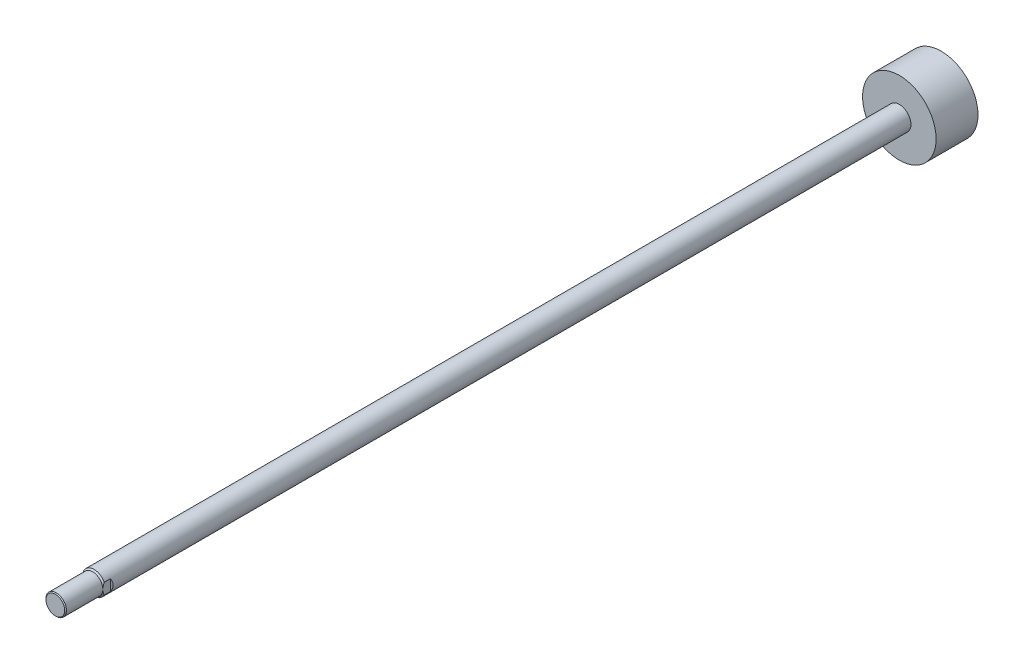
ISO-10303-21;
HEADER;
FILE_DESCRIPTION(('STEP AP214'),'2;1');
FILE_NAME('part.step','',(''),(''),'','','');
FILE_SCHEMA(('AUTOMOTIVE_DESIGN { 1 0 10303 214 1 1 1 1 }'));
ENDSEC;
DATA;
#1=APPLICATION_CONTEXT('core data for automotive mechanical design processes');
#2=APPLICATION_PROTOCOL_DEFINITION('international standard','automotive_design',2000,#1);
#3=PRODUCT_CONTEXT('',#1,'mechanical');
#4=PRODUCT('Part','Part','',(#3));
#5=PRODUCT_RELATED_PRODUCT_CATEGORY('part','',(#4));
#6=PRODUCT_DEFINITION_FORMATION('','',#4);
#7=PRODUCT_DEFINITION_CONTEXT('part definition',#1,'design');
#8=PRODUCT_DEFINITION('design','',#6,#7);
#9=PRODUCT_DEFINITION_SHAPE('','',#8);
#10=(LENGTH_UNIT() NAMED_UNIT(*) SI_UNIT(.MILLI.,.METRE.));
#11=(NAMED_UNIT(*) PLANE_ANGLE_UNIT() SI_UNIT($,.RADIAN.));
#12=(NAMED_UNIT(*) SI_UNIT($,.STERADIAN.) SOLID_ANGLE_UNIT());
#13=UNCERTAINTY_MEASURE_WITH_UNIT(LENGTH_MEASURE(1.E-05),#10,'distance_accuracy_value','');
#14=(GEOMETRIC_REPRESENTATION_CONTEXT(3) GLOBAL_UNCERTAINTY_ASSIGNED_CONTEXT((#13)) GLOBAL_UNIT_ASSIGNED_CONTEXT((#10,
#11,#12)) REPRESENTATION_CONTEXT('',''));
#15=CARTESIAN_POINT('',(0.,0.,0.));
#16=DIRECTION('',(0.,0.,1.));
#17=DIRECTION('',(1.,0.,0.));
#18=AXIS2_PLACEMENT_3D('',#15,#16,#17);
#19=CARTESIAN_POINT('',(0.,0.,10.5000000000001));
#20=DIRECTION('',(0.,0.,-1.));
#21=DIRECTION('',(-1.,0.,0.));
#22=AXIS2_PLACEMENT_3D('',#19,#20,#21);
#23=CONICAL_SURFACE('',#22,12.5,0.785398163397467);
#24=CARTESIAN_POINT('',(0.,0.,10.5000000000001));
#25=DIRECTION('',(0.,0.,1.));
#26=DIRECTION('',(1.,0.,0.));
#27=AXIS2_PLACEMENT_3D('',#24,#25,#26);
#28=CIRCLE('',#27,12.5);
#29=CARTESIAN_POINT('',(11.,5.93717104351896,10.5000000000001));
#30=VERTEX_POINT('',#29);
#31=CARTESIAN_POINT('',(-11.,5.93717104351896,10.5000000000001));
#32=VERTEX_POINT('',#31);
#33=EDGE_CURVE('E120',#30,#32,#28,.T.);
#34=ORIENTED_EDGE('',*,*,#33,.T.);
#35=CARTESIAN_POINT('',(-11.,-30.3737777901921,-9.30427800226955));
#36=CARTESIAN_POINT('',(-11.,-30.0229063540529,-8.97437695331711));
#37=CARTESIAN_POINT('',(-11.,-29.6717066790662,-8.64482502476977));
#38=CARTESIAN_POINT('',(-11.,-28.9685770270119,-7.98649999018541));
#39=CARTESIAN_POINT('',(-11.,-28.6166470486584,-7.65772688552205));
#40=CARTESIAN_POINT('',(-11.,-27.5596186699526,-6.67266663693586));
#41=CARTESIAN_POINT('',(-11.,-26.8533157788468,-6.01767051110847));
#42=CARTESIAN_POINT('',(-11.,-25.4349123512362,-4.71026616975852));
#43=CARTESIAN_POINT('',(-11.,-24.7228015119403,-4.05786912051483));
#44=CARTESIAN_POINT('',(-11.,-23.2936170840664,-2.75857202015826));
#45=CARTESIAN_POINT('',(-11.,-22.5765436397661,-2.11167181044391));
#46=CARTESIAN_POINT('',(-11.,-21.0606945297453,-0.757615978221944));
#47=CARTESIAN_POINT('',(-11.,-20.2612212573375,-0.0512385887505946));
#48=CARTESIAN_POINT('',(-11.,-19.0542106064668,0.999453534212534));
#49=CARTESIAN_POINT('',(-11.,-18.6505514081433,1.34822399666167));
#50=CARTESIAN_POINT('',(-11.,-17.8401937123821,2.04221745773091));
#51=CARTESIAN_POINT('',(-11.,-17.4334952257531,2.38744046895657));
#52=CARTESIAN_POINT('',(-11.,-16.6170993334455,3.0731590701502));
#53=CARTESIAN_POINT('',(-11.,-16.2074069270912,3.413660605241));
#54=CARTESIAN_POINT('',(-11.,-15.3837941215437,4.08953454430709));
#55=CARTESIAN_POINT('',(-11.,-14.9698736499337,4.42490686018441));
#56=CARTESIAN_POINT('',(-11.,-14.1370695660154,5.08928571580761));
#57=CARTESIAN_POINT('',(-11.,-13.7181868734802,5.41829340639865));
#58=CARTESIAN_POINT('',(-11.,-12.8743810744199,6.06845305145992));
#59=CARTESIAN_POINT('',(-11.,-12.4494582668419,6.38960539259393));
#60=CARTESIAN_POINT('',(-11.,-11.6784557577223,6.95839901584683));
#61=CARTESIAN_POINT('',(-11.,-11.3337033170845,7.20783666055259));
#62=CARTESIAN_POINT('',(-11.,-10.6386998782597,7.69897273167353));
#63=CARTESIAN_POINT('',(-11.,-10.2884487525087,7.94067097814588));
#64=CARTESIAN_POINT('',(-11.,-9.58092508069719,8.41490262835491));
#65=CARTESIAN_POINT('',(-11.,-9.22364179900027,8.64742007542739));
#66=CARTESIAN_POINT('',(-11.,-8.5015342266699,9.10046734630099));
#67=CARTESIAN_POINT('',(-11.,-8.13671023098719,9.3209976377528));
#68=CARTESIAN_POINT('',(-11.,-7.40619318173111,9.74237663896798));
#69=CARTESIAN_POINT('',(-11.,-7.04068604274017,9.94354569077682));
#70=CARTESIAN_POINT('',(-11.,-6.30000413092141,10.3275986353661));
#71=CARTESIAN_POINT('',(-11.,-5.92482731055884,10.5104786147949));
#72=CARTESIAN_POINT('',(-11.,-5.16503852122758,10.8524533149703));
#73=CARTESIAN_POINT('',(-11.,-4.78045826730282,11.0116178096462));
#74=CARTESIAN_POINT('',(-11.,-4.00057373635847,11.3006950374231));
#75=CARTESIAN_POINT('',(-11.,-3.6052777808523,11.43062977939));
#76=CARTESIAN_POINT('',(-11.,-2.93173933823261,11.6190388059141));
#77=CARTESIAN_POINT('',(-11.,-2.65617699403574,11.6871038553572));
#78=CARTESIAN_POINT('',(-11.,-2.10100533429474,11.8044358751432));
#79=CARTESIAN_POINT('',(-11.,-1.82139571113459,11.8537014087471));
#80=CARTESIAN_POINT('',(-11.,-1.26014853276528,11.9315306660556));
#81=CARTESIAN_POINT('',(-11.,-0.978519765258069,11.9601570798599));
#82=CARTESIAN_POINT('',(-11.,-0.413884147058562,11.9958235803247));
#83=CARTESIAN_POINT('',(-11.,-0.13087725978694,12.0028630908429));
#84=CARTESIAN_POINT('',(-11.,0.483720502296104,11.9943609657316));
#85=CARTESIAN_POINT('',(-11.,0.81526124951187,11.9747097024158));
#86=CARTESIAN_POINT('',(-11.,1.47533853964694,11.9063652029098));
#87=CARTESIAN_POINT('',(-11.,1.80387446821454,11.8576661568047));
#88=CARTESIAN_POINT('',(-11.,2.45960905462746,11.7330215715066));
#89=CARTESIAN_POINT('',(-11.,2.78674828640074,11.6567673842277));
#90=CARTESIAN_POINT('',(-11.,3.43442351034812,11.4805342077058));
#91=CARTESIAN_POINT('',(-11.,3.75496060244845,11.3805592057055));
#92=CARTESIAN_POINT('',(-11.,4.43860398219218,11.1432333450099));
#93=CARTESIAN_POINT('',(-11.,4.80052089453188,11.0024816953722));
#94=CARTESIAN_POINT('',(-11.,5.51514756853484,10.6991023941188));
#95=CARTESIAN_POINT('',(-11.,5.86785294863752,10.5364645505205));
#96=CARTESIAN_POINT('',(-11.,6.56572434411173,10.1931210622779));
#97=CARTESIAN_POINT('',(-11.,6.9108618867172,10.0123579928071));
#98=CARTESIAN_POINT('',(-11.,7.59326398254634,9.63674700867484));
#99=CARTESIAN_POINT('',(-11.,7.93052975814919,9.44190130036884));
#100=CARTESIAN_POINT('',(-11.,8.58397946116312,9.04939310932823));
#101=CARTESIAN_POINT('',(-11.,8.90044939127748,8.85220428937632));
#102=CARTESIAN_POINT('',(-11.,9.5279192078348,8.44928060590444));
#103=CARTESIAN_POINT('',(-11.,9.83891865777885,8.24354506479058));
#104=CARTESIAN_POINT('',(-11.,10.4536287734865,7.82674595883109));
#105=CARTESIAN_POINT('',(-11.,10.7573781228191,7.61573923887487));
#106=CARTESIAN_POINT('',(-11.,11.3606748546706,7.18797464933807));
#107=CARTESIAN_POINT('',(-11.,11.6602234083216,6.9712184334145));
#108=CARTESIAN_POINT('',(-11.,11.9580092344666,6.75210829517929));
#109=B_SPLINE_CURVE_WITH_KNOTS('',3,(#35,#36,#37,#38,#39,#40,#41,#42,#43,#44,#45,#46,#47,#48,
#49,#50,#51,#52,#53,#54,#55,#56,#57,#58,#59,#60,#61,#62,#63,#64,#65,#66,#67,#68,#69,#70,#71,#72,
#73,#74,#75,#76,#77,#78,#79,#80,#81,#82,#83,#84,#85,#86,#87,#88,#89,#90,#91,#92,#93,#94,#95,#96,
#97,#98,#99,#100,#101,#102,#103,#104,#105,#106,#107,#108),.UNSPECIFIED.,.F.,.F.,(4,2,2,2,2,2,2,
2,2,2,2,2,2,2,2,2,2,2,2,2,2,2,2,2,2,2,2,2,2,2,2,2,2,2,2,2,4),(0.,1.44482111634278,
2.88964477910512,5.77943197448876,8.67673740717784,11.5739589574956,14.7743498753899,
16.3747196187949,17.9750836734584,19.5732057841902,21.1713553130435,22.7692131127942,
24.3669921022818,25.6434886843687,26.9200149237839,28.1986700566298,29.4772752698982,
30.7284995702251,31.9799910274049,33.2277244758003,34.4745152612281,35.3254842608641,
36.1765182821512,37.0249563212923,37.8734170045637,38.8684037373762,39.8635895465815,
40.8702868077079,41.8768149723518,43.0408783830398,44.2054857639148,45.3739070401562,
46.542145652645,47.6606130892623,48.7791693691289,49.8886408706045,50.997796656384),.UNSPECIFIED.);
#110=CARTESIAN_POINT('',(-11.,0.,12.));
#111=VERTEX_POINT('',#110);
#112=EDGE_CURVE('E90',#32,#111,#109,.F.);
#113=ORIENTED_EDGE('',*,*,#112,.T.);
#114=CARTESIAN_POINT('',(0.,0.,12.));
#115=DIRECTION('',(0.,0.,1.));
#116=DIRECTION('',(1.,0.,0.));
#117=AXIS2_PLACEMENT_3D('',#114,#115,#116);
#118=CIRCLE('',#117,11.);
#119=CARTESIAN_POINT('',(11.,0.,12.));
#120=VERTEX_POINT('',#119);
#121=EDGE_CURVE('E116',#120,#111,#118,.T.);
#122=ORIENTED_EDGE('',*,*,#121,.F.);
#123=CARTESIAN_POINT('',(11.,-30.3737777901921,-9.30427800226955));
#124=CARTESIAN_POINT('',(11.,-30.0229063540529,-8.97437695331711));
#125=CARTESIAN_POINT('',(11.,-29.6717066790662,-8.64482502476977));
#126=CARTESIAN_POINT('',(11.,-28.9685770270119,-7.98649999018541));
#127=CARTESIAN_POINT('',(11.,-28.6166470486584,-7.65772688552205));
#128=CARTESIAN_POINT('',(11.,-27.5596186699526,-6.67266663693586));
#129=CARTESIAN_POINT('',(11.,-26.8533157788468,-6.01767051110847));
#130=CARTESIAN_POINT('',(11.,-25.4349123512362,-4.71026616975852));
#131=CARTESIAN_POINT('',(11.,-24.7228015119403,-4.05786912051483));
#132=CARTESIAN_POINT('',(11.,-23.2936170840664,-2.75857202015826));
#133=CARTESIAN_POINT('',(11.,-22.5765436397661,-2.11167181044391));
#134=CARTESIAN_POINT('',(11.,-21.0606945297453,-0.757615978221944));
#135=CARTESIAN_POINT('',(11.,-20.2612212573375,-0.0512385887505946));
#136=CARTESIAN_POINT('',(11.,-19.0542106064668,0.999453534212534));
#137=CARTESIAN_POINT('',(11.,-18.6505514081433,1.34822399666167));
#138=CARTESIAN_POINT('',(11.,-17.8401937123821,2.04221745773091));
#139=CARTESIAN_POINT('',(11.,-17.4334952257531,2.38744046895657));
#140=CARTESIAN_POINT('',(11.,-16.6170993334455,3.0731590701502));
#141=CARTESIAN_POINT('',(11.,-16.2074069270912,3.413660605241));
#142=CARTESIAN_POINT('',(11.,-15.3837941215437,4.08953454430709));
#143=CARTESIAN_POINT('',(11.,-14.9698736499337,4.42490686018441));
#144=CARTESIAN_POINT('',(11.,-14.1370695660154,5.08928571580761));
#145=CARTESIAN_POINT('',(11.,-13.7181868734802,5.41829340639865));
#146=CARTESIAN_POINT('',(11.,-12.8743810744199,6.06845305145992));
#147=CARTESIAN_POINT('',(11.,-12.4494582668419,6.38960539259393));
#148=CARTESIAN_POINT('',(11.,-11.6784557577223,6.95839901584683));
#149=CARTESIAN_POINT('',(11.,-11.3337033170845,7.20783666055259));
#150=CARTESIAN_POINT('',(11.,-10.6386998782597,7.69897273167353));
#151=CARTESIAN_POINT('',(11.,-10.2884487525087,7.94067097814588));
#152=CARTESIAN_POINT('',(11.,-9.58092508069719,8.41490262835491));
#153=CARTESIAN_POINT('',(11.,-9.22364179900027,8.64742007542739));
#154=CARTESIAN_POINT('',(11.,-8.5015342266699,9.10046734630099));
#155=CARTESIAN_POINT('',(11.,-8.13671023098719,9.3209976377528));
#156=CARTESIAN_POINT('',(11.,-7.40619318173111,9.74237663896798));
#157=CARTESIAN_POINT('',(11.,-7.04068604274017,9.94354569077682));
#158=CARTESIAN_POINT('',(11.,-6.30000413092141,10.3275986353661));
#159=CARTESIAN_POINT('',(11.,-5.92482731055884,10.5104786147949));
#160=CARTESIAN_POINT('',(11.,-5.16503852122758,10.8524533149703));
#161=CARTESIAN_POINT('',(11.,-4.78045826730282,11.0116178096462));
#162=CARTESIAN_POINT('',(11.,-4.00057373635847,11.3006950374231));
#163=CARTESIAN_POINT('',(11.,-3.6052777808523,11.43062977939));
#164=CARTESIAN_POINT('',(11.,-2.93173933823261,11.6190388059141));
#165=CARTESIAN_POINT('',(11.,-2.65617699403574,11.6871038553572));
#166=CARTESIAN_POINT('',(11.,-2.10100533429474,11.8044358751432));
#167=CARTESIAN_POINT('',(11.,-1.82139571113459,11.8537014087471));
#168=CARTESIAN_POINT('',(11.,-1.26014853276528,11.9315306660556));
#169=CARTESIAN_POINT('',(11.,-0.978519765258069,11.9601570798599));
#170=CARTESIAN_POINT('',(11.,-0.413884147058562,11.9958235803247));
#171=CARTESIAN_POINT('',(11.,-0.13087725978694,12.0028630908429));
#172=CARTESIAN_POINT('',(11.,0.483720502296104,11.9943609657316));
#173=CARTESIAN_POINT('',(11.,0.81526124951187,11.9747097024158));
#174=CARTESIAN_POINT('',(11.,1.47533853964694,11.9063652029098));
#175=CARTESIAN_POINT('',(11.,1.80387446821454,11.8576661568047));
#176=CARTESIAN_POINT('',(11.,2.45960905462746,11.7330215715066));
#177=CARTESIAN_POINT('',(11.,2.78674828640074,11.6567673842277));
#178=CARTESIAN_POINT('',(11.,3.43442351034812,11.4805342077058));
#179=CARTESIAN_POINT('',(11.,3.75496060244845,11.3805592057055));
#180=CARTESIAN_POINT('',(11.,4.43860398219218,11.1432333450099));
#181=CARTESIAN_POINT('',(11.,4.80052089453188,11.0024816953722));
#182=CARTESIAN_POINT('',(11.,5.51514756853484,10.6991023941188));
#183=CARTESIAN_POINT('',(11.,5.86785294863752,10.5364645505205));
#184=CARTESIAN_POINT('',(11.,6.56572434411173,10.1931210622779));
#185=CARTESIAN_POINT('',(11.,6.9108618867172,10.0123579928071));
#186=CARTESIAN_POINT('',(11.,7.59326398254634,9.63674700867484));
#187=CARTESIAN_POINT('',(11.,7.93052975814919,9.44190130036884));
#188=CARTESIAN_POINT('',(11.,8.58397946116312,9.04939310932823));
#189=CARTESIAN_POINT('',(11.,8.90044939127748,8.85220428937632));
#190=CARTESIAN_POINT('',(11.,9.5279192078348,8.44928060590444));
#191=CARTESIAN_POINT('',(11.,9.83891865777885,8.24354506479058));
#192=CARTESIAN_POINT('',(11.,10.4536287734865,7.82674595883109));
#193=CARTESIAN_POINT('',(11.,10.7573781228191,7.61573923887487));
#194=CARTESIAN_POINT('',(11.,11.3606748546706,7.18797464933807));
#195=CARTESIAN_POINT('',(11.,11.6602234083216,6.9712184334145));
#196=CARTESIAN_POINT('',(11.,11.9580092344666,6.75210829517929));
#197=B_SPLINE_CURVE_WITH_KNOTS('',3,(#123,#124,#125,#126,#127,#128,#129,#130,#131,#132,#133,
#134,#135,#136,#137,#138,#139,#140,#141,#142,#143,#144,#145,#146,#147,#148,#149,#150,#151,#152,
#153,#154,#155,#156,#157,#158,#159,#160,#161,#162,#163,#164,#165,#166,#167,#168,#169,#170,#171,
#172,#173,#174,#175,#176,#177,#178,#179,#180,#181,#182,#183,#184,#185,#186,#187,#188,#189,#190,
#191,#192,#193,#194,#195,#196),.UNSPECIFIED.,.F.,.F.,(4,2,2,2,2,2,2,2,2,2,2,2,2,2,2,2,2,2,2,2,2,
2,2,2,2,2,2,2,2,2,2,2,2,2,2,2,4),(0.,1.44482111634278,2.88964477910512,5.77943197448876,
8.67673740717784,11.5739589574956,14.7743498753899,16.3747196187949,17.9750836734584,
19.5732057841902,21.1713553130435,22.7692131127942,24.3669921022818,25.6434886843687,
26.9200149237839,28.1986700566298,29.4772752698982,30.7284995702251,31.9799910274049,
33.2277244758003,34.4745152612281,35.3254842608641,36.1765182821512,37.0249563212923,
37.8734170045637,38.8684037373762,39.8635895465815,40.8702868077079,41.8768149723518,
43.0408783830398,44.2054857639148,45.3739070401562,46.542145652645,47.6606130892623,
48.7791693691289,49.8886408706045,50.997796656384),.UNSPECIFIED.);
#198=EDGE_CURVE('E133',#120,#30,#197,.T.);
#199=ORIENTED_EDGE('',*,*,#198,.T.);
#200=EDGE_LOOP('',(#34,#113,#122,#199));
#201=FACE_BOUND('',#200,.T.);
#202=ADVANCED_FACE('F39',(#201),#23,.T.);
#203=CARTESIAN_POINT('',(0.,0.,52.));
#204=DIRECTION('',(0.,0.,-1.));
#205=DIRECTION('',(-1.,0.,0.));
#206=AXIS2_PLACEMENT_3D('',#203,#204,#205);
#207=PLANE('',#206);
#208=CARTESIAN_POINT('',(0.,0.,52.));
#209=DIRECTION('',(0.,0.,1.));
#210=DIRECTION('',(1.,0.,0.));
#211=AXIS2_PLACEMENT_3D('',#208,#209,#210);
#212=CIRCLE('',#211,10.08);
#213=CARTESIAN_POINT('',(10.08,0.,52.));
#214=VERTEX_POINT('',#213);
#215=EDGE_CURVE('E110',#214,#214,#212,.T.);
#216=ORIENTED_EDGE('',*,*,#215,.T.);
#217=EDGE_LOOP('',(#216));
#218=FACE_BOUND('',#217,.T.);
#219=ADVANCED_FACE('F41',(#218),#207,.F.);
#220=CARTESIAN_POINT('',(0.,0.,51.08));
#221=DIRECTION('',(0.,0.,-1.));
#222=DIRECTION('',(-1.,0.,0.));
#223=AXIS2_PLACEMENT_3D('',#220,#221,#222);
#224=CONICAL_SURFACE('',#223,11.,0.78539816339743);
#225=ORIENTED_EDGE('',*,*,#215,.F.);
#226=EDGE_LOOP('',(#225));
#227=FACE_BOUND('',#226,.T.);
#228=CARTESIAN_POINT('',(0.,0.,51.08));
#229=DIRECTION('',(0.,0.,1.));
#230=DIRECTION('',(1.,0.,0.));
#231=AXIS2_PLACEMENT_3D('',#228,#229,#230);
#232=CIRCLE('',#231,11.);
#233=CARTESIAN_POINT('',(11.,0.,51.08));
#234=VERTEX_POINT('',#233);
#235=EDGE_CURVE('E113',#234,#234,#232,.T.);
#236=ORIENTED_EDGE('',*,*,#235,.T.);
#237=EDGE_LOOP('',(#236));
#238=FACE_BOUND('',#237,.T.);
#239=ADVANCED_FACE('F178',(#227,#238),#224,.T.);
#240=CARTESIAN_POINT('',(0.,0.,-899.5));
#241=DIRECTION('',(0.,0.,1.));
#242=DIRECTION('',(1.,0.,0.));
#243=AXIS2_PLACEMENT_3D('',#240,#241,#242);
#244=CYLINDRICAL_SURFACE('',#243,11.);
#245=ORIENTED_EDGE('',*,*,#235,.F.);
#246=EDGE_LOOP('',(#245));
#247=FACE_BOUND('',#246,.T.);
#248=ORIENTED_EDGE('',*,*,#121,.T.);
#249=EDGE_CURVE('E119',#111,#120,#118,.T.);
#250=ORIENTED_EDGE('',*,*,#249,.T.);
#251=EDGE_LOOP('',(#248,#250));
#252=FACE_BOUND('',#251,.T.);
#253=ADVANCED_FACE('F171',(#247,#252),#244,.T.);
#254=ORIENTED_EDGE('',*,*,#249,.F.);
#255=CARTESIAN_POINT('',(-11.,-5.93717104351896,10.5000000000001));
#256=VERTEX_POINT('',#255);
#257=EDGE_CURVE('E95',#111,#256,#109,.F.);
#258=ORIENTED_EDGE('',*,*,#257,.T.);
#259=CARTESIAN_POINT('',(11.,-5.93717104351896,10.5000000000001));
#260=VERTEX_POINT('',#259);
#261=EDGE_CURVE('E122',#256,#260,#28,.T.);
#262=ORIENTED_EDGE('',*,*,#261,.T.);
#263=EDGE_CURVE('E132',#260,#120,#197,.T.);
#264=ORIENTED_EDGE('',*,*,#263,.T.);
#265=EDGE_LOOP('',(#254,#258,#262,#264));
#266=FACE_BOUND('',#265,.T.);
#267=ADVANCED_FACE('F142',(#266),#23,.T.);
#268=CARTESIAN_POINT('',(0.,0.,-899.5));
#269=DIRECTION('',(0.,0.,1.));
#270=DIRECTION('',(1.,0.,0.));
#271=AXIS2_PLACEMENT_3D('',#268,#269,#270);
#272=CYLINDRICAL_SURFACE('',#271,12.5);
#273=DIRECTION('',(0.,0.,1.));
#274=VECTOR('',#273,1.);
#275=CARTESIAN_POINT('',(-11.,-5.93717104351896,-899.5));
#276=LINE('',#275,#274);
#277=CARTESIAN_POINT('',(-11.,-5.93717104351896,3.90000000000001));
#278=VERTEX_POINT('',#277);
#279=EDGE_CURVE('E11',#256,#278,#276,.F.);
#280=ORIENTED_EDGE('',*,*,#279,.T.);
#281=CARTESIAN_POINT('',(0.,0.,14.8999999999999));
#282=DIRECTION('',(0.707106781186546,0.,-0.707106781186549));
#283=DIRECTION('',(0.707106781186549,0.,0.707106781186546));
#284=AXIS2_PLACEMENT_3D('',#281,#282,#283);
#285=ELLIPSE('',#284,17.6776695296636,12.5);
#286=CARTESIAN_POINT('',(-11.,5.93717104351896,3.89999999999999));
#287=VERTEX_POINT('',#286);
#288=EDGE_CURVE('E53',#278,#287,#285,.T.);
#289=ORIENTED_EDGE('',*,*,#288,.T.);
#290=DIRECTION('',(0.,0.,1.));
#291=VECTOR('',#290,1.);
#292=CARTESIAN_POINT('',(-11.,5.93717104351896,-899.5));
#293=LINE('',#292,#291);
#294=EDGE_CURVE('E47',#287,#32,#293,.T.);
#295=ORIENTED_EDGE('',*,*,#294,.T.);
#296=ORIENTED_EDGE('',*,*,#33,.F.);
#297=DIRECTION('',(0.,0.,1.));
#298=VECTOR('',#297,1.);
#299=CARTESIAN_POINT('',(11.,5.93717104351896,-899.5));
#300=LINE('',#299,#298);
#301=CARTESIAN_POINT('',(11.,5.93717104351896,3.90000000000001));
#302=VERTEX_POINT('',#301);
#303=EDGE_CURVE('E107',#30,#302,#300,.F.);
#304=ORIENTED_EDGE('',*,*,#303,.T.);
#305=CARTESIAN_POINT('',(0.,0.,14.8999999999998));
#306=DIRECTION('',(-0.707106781186542,0.,-0.707106781186553));
#307=DIRECTION('',(-0.707106781186553,0.,0.707106781186542));
#308=AXIS2_PLACEMENT_3D('',#305,#306,#307);
#309=ELLIPSE('',#308,17.6776695296635,12.5);
#310=CARTESIAN_POINT('',(11.,-5.93717104351896,3.89999999999998));
#311=VERTEX_POINT('',#310);
#312=EDGE_CURVE('E103',#302,#311,#309,.T.);
#313=ORIENTED_EDGE('',*,*,#312,.T.);
#314=DIRECTION('',(0.,0.,1.));
#315=VECTOR('',#314,1.);
#316=CARTESIAN_POINT('',(11.,-5.93717104351896,-899.5));
#317=LINE('',#316,#315);
#318=EDGE_CURVE('E100',#311,#260,#317,.T.);
#319=ORIENTED_EDGE('',*,*,#318,.T.);
#320=ORIENTED_EDGE('',*,*,#261,.F.);
#321=EDGE_LOOP('',(#280,#289,#295,#296,#304,#313,#319,#320));
#322=FACE_BOUND('',#321,.T.);
#323=CARTESIAN_POINT('',(0.,0.,-854.5));
#324=DIRECTION('',(0.,0.,1.));
#325=DIRECTION('',(1.,0.,0.));
#326=AXIS2_PLACEMENT_3D('',#323,#324,#325);
#327=CIRCLE('',#326,12.5);
#328=CARTESIAN_POINT('',(12.5,0.,-854.5));
#329=VERTEX_POINT('',#328);
#330=EDGE_CURVE('E123',#329,#329,#327,.T.);
#331=ORIENTED_EDGE('',*,*,#330,.T.);
#332=EDGE_LOOP('',(#331));
#333=FACE_BOUND('',#332,.T.);
#334=ADVANCED_FACE('F97',(#322,#333),#272,.T.);
#335=CARTESIAN_POINT('',(0.,12.5,-854.5));
#336=DIRECTION('',(0.,0.,-1.));
#337=DIRECTION('',(-1.,0.,0.));
#338=AXIS2_PLACEMENT_3D('',#335,#336,#337);
#339=PLANE('',#338);
#340=ORIENTED_EDGE('',*,*,#330,.F.);
#341=EDGE_LOOP('',(#340));
#342=FACE_BOUND('',#341,.T.);
#343=CARTESIAN_POINT('',(0.,0.,-854.5));
#344=DIRECTION('',(0.,0.,1.));
#345=DIRECTION('',(1.,0.,0.));
#346=AXIS2_PLACEMENT_3D('',#343,#344,#345);
#347=CIRCLE('',#346,39.5);
#348=CARTESIAN_POINT('',(39.5,0.,-854.5));
#349=VERTEX_POINT('',#348);
#350=EDGE_CURVE('E126',#349,#349,#347,.T.);
#351=ORIENTED_EDGE('',*,*,#350,.T.);
#352=EDGE_LOOP('',(#351));
#353=FACE_BOUND('',#352,.T.);
#354=ADVANCED_FACE('F163',(#342,#353),#339,.F.);
#355=CARTESIAN_POINT('',(0.,0.,-899.5));
#356=DIRECTION('',(0.,0.,1.));
#357=DIRECTION('',(1.,0.,0.));
#358=AXIS2_PLACEMENT_3D('',#355,#356,#357);
#359=CYLINDRICAL_SURFACE('',#358,39.5);
#360=ORIENTED_EDGE('',*,*,#350,.F.);
#361=EDGE_LOOP('',(#360));
#362=FACE_BOUND('',#361,.T.);
#363=CARTESIAN_POINT('',(0.,0.,-899.5));
#364=DIRECTION('',(0.,0.,1.));
#365=DIRECTION('',(1.,0.,0.));
#366=AXIS2_PLACEMENT_3D('',#363,#364,#365);
#367=CIRCLE('',#366,39.5);
#368=CARTESIAN_POINT('',(39.5,0.,-899.5));
#369=VERTEX_POINT('',#368);
#370=EDGE_CURVE('E129',#369,#369,#367,.T.);
#371=ORIENTED_EDGE('',*,*,#370,.T.);
#372=EDGE_LOOP('',(#371));
#373=FACE_BOUND('',#372,.T.);
#374=ADVANCED_FACE('F159',(#362,#373),#359,.T.);
#375=CARTESIAN_POINT('',(0.,39.5,-899.5));
#376=DIRECTION('',(0.,0.,1.));
#377=DIRECTION('',(1.,0.,0.));
#378=AXIS2_PLACEMENT_3D('',#375,#376,#377);
#379=PLANE('',#378);
#380=ORIENTED_EDGE('',*,*,#370,.F.);
#381=EDGE_LOOP('',(#380));
#382=FACE_BOUND('',#381,.T.);
#383=ADVANCED_FACE('F155',(#382),#379,.F.);
#384=CARTESIAN_POINT('',(12.5,-12.5,2.4));
#385=DIRECTION('',(-0.707106781186542,0.,-0.707106781186553));
#386=DIRECTION('',(-0.707106781186553,0.,0.707106781186542));
#387=AXIS2_PLACEMENT_3D('',#384,#385,#386);
#388=PLANE('',#387);
#389=DIRECTION('',(0.,1.,0.));
#390=VECTOR('',#389,1.);
#391=CARTESIAN_POINT('',(11.,-12.5,3.89999999999998));
#392=LINE('',#391,#390);
#393=EDGE_CURVE('E61',#311,#302,#392,.T.);
#394=ORIENTED_EDGE('',*,*,#393,.F.);
#395=ORIENTED_EDGE('',*,*,#312,.F.);
#396=EDGE_LOOP('',(#394,#395));
#397=FACE_BOUND('',#396,.T.);
#398=ADVANCED_FACE('F151',(#397),#388,.F.);
#399=CARTESIAN_POINT('',(11.,-12.5,3.89999999999998));
#400=DIRECTION('',(-1.,0.,0.));
#401=DIRECTION('',(0.,0.,1.));
#402=AXIS2_PLACEMENT_3D('',#399,#400,#401);
#403=PLANE('',#402);
#404=ORIENTED_EDGE('',*,*,#393,.T.);
#405=ORIENTED_EDGE('',*,*,#303,.F.);
#406=ORIENTED_EDGE('',*,*,#198,.F.);
#407=ORIENTED_EDGE('',*,*,#263,.F.);
#408=ORIENTED_EDGE('',*,*,#318,.F.);
#409=EDGE_LOOP('',(#404,#405,#406,#407,#408));
#410=FACE_BOUND('',#409,.T.);
#411=ADVANCED_FACE('F146',(#410),#403,.F.);
#412=CARTESIAN_POINT('',(-11.,-12.5,3.89999999999999));
#413=DIRECTION('',(0.707106781186546,0.,-0.707106781186549));
#414=DIRECTION('',(-0.707106781186549,0.,-0.707106781186546));
#415=AXIS2_PLACEMENT_3D('',#412,#413,#414);
#416=PLANE('',#415);
#417=DIRECTION('',(0.,1.,0.));
#418=VECTOR('',#417,1.);
#419=CARTESIAN_POINT('',(-11.,-12.5,3.89999999999999));
#420=LINE('',#419,#418);
#421=EDGE_CURVE('E88',#278,#287,#420,.T.);
#422=ORIENTED_EDGE('',*,*,#421,.T.);
#423=ORIENTED_EDGE('',*,*,#288,.F.);
#424=EDGE_LOOP('',(#422,#423));
#425=FACE_BOUND('',#424,.T.);
#426=ADVANCED_FACE('F94',(#425),#416,.F.);
#427=CARTESIAN_POINT('',(-11.,-12.5,12.));
#428=DIRECTION('',(1.,0.,0.));
#429=DIRECTION('',(0.,0.,-1.));
#430=AXIS2_PLACEMENT_3D('',#427,#428,#429);
#431=PLANE('',#430);
#432=ORIENTED_EDGE('',*,*,#421,.F.);
#433=ORIENTED_EDGE('',*,*,#279,.F.);
#434=ORIENTED_EDGE('',*,*,#257,.F.);
#435=ORIENTED_EDGE('',*,*,#112,.F.);
#436=ORIENTED_EDGE('',*,*,#294,.F.);
#437=EDGE_LOOP('',(#432,#433,#434,#435,#436));
#438=FACE_BOUND('',#437,.T.);
#439=ADVANCED_FACE('F87',(#438),#431,.F.);
#440=CLOSED_SHELL('',(#202,#219,#239,#253,#267,#334,#354,#374,#383,#398,#411,#426,#439));
#441=MANIFOLD_SOLID_BREP('B2',#440);
#442=ADVANCED_BREP_SHAPE_REPRESENTATION('',(#18,#441),#14);
#443=SHAPE_DEFINITION_REPRESENTATION(#9,#442);
ENDSEC;
END-ISO-10303-21;
